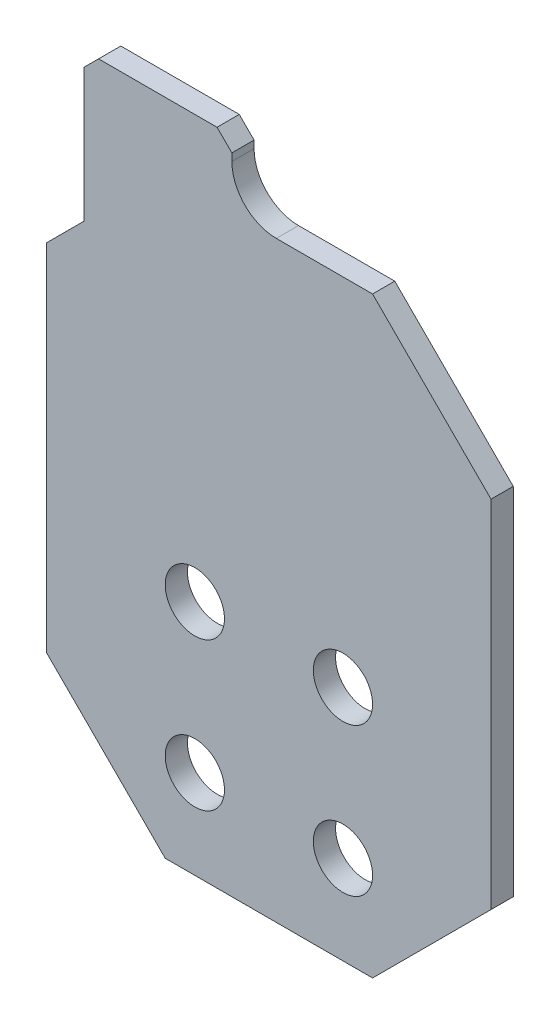
ISO-10303-21;
HEADER;
FILE_DESCRIPTION(('STEP AP214'),'2;1');
FILE_NAME('part.step','',(''),(''),'','','');
FILE_SCHEMA(('AUTOMOTIVE_DESIGN { 1 0 10303 214 1 1 1 1 }'));
ENDSEC;
DATA;
#1=APPLICATION_CONTEXT('core data for automotive mechanical design processes');
#2=APPLICATION_PROTOCOL_DEFINITION('international standard','automotive_design',2000,#1);
#3=PRODUCT_CONTEXT('',#1,'mechanical');
#4=PRODUCT('Part','Part','',(#3));
#5=PRODUCT_RELATED_PRODUCT_CATEGORY('part','',(#4));
#6=PRODUCT_DEFINITION_FORMATION('','',#4);
#7=PRODUCT_DEFINITION_CONTEXT('part definition',#1,'design');
#8=PRODUCT_DEFINITION('design','',#6,#7);
#9=PRODUCT_DEFINITION_SHAPE('','',#8);
#10=(LENGTH_UNIT() NAMED_UNIT(*) SI_UNIT(.MILLI.,.METRE.));
#11=(NAMED_UNIT(*) PLANE_ANGLE_UNIT() SI_UNIT($,.RADIAN.));
#12=(NAMED_UNIT(*) SI_UNIT($,.STERADIAN.) SOLID_ANGLE_UNIT());
#13=UNCERTAINTY_MEASURE_WITH_UNIT(LENGTH_MEASURE(1.E-05),#10,'distance_accuracy_value','');
#14=(GEOMETRIC_REPRESENTATION_CONTEXT(3) GLOBAL_UNCERTAINTY_ASSIGNED_CONTEXT((#13)) GLOBAL_UNIT_ASSIGNED_CONTEXT((#10,
#11,#12)) REPRESENTATION_CONTEXT('',''));
#15=CARTESIAN_POINT('',(0.,0.,0.));
#16=DIRECTION('',(0.,0.,1.));
#17=DIRECTION('',(1.,0.,0.));
#18=AXIS2_PLACEMENT_3D('',#15,#16,#17);
#19=CARTESIAN_POINT('',(0.,0.,1.5));
#20=DIRECTION('',(0.,0.,1.));
#21=DIRECTION('',(1.,0.,0.));
#22=AXIS2_PLACEMENT_3D('',#19,#20,#21);
#23=PLANE('',#22);
#24=DIRECTION('',(-1.,0.,0.));
#25=VECTOR('',#24,1.);
#26=CARTESIAN_POINT('',(0.,0.,1.5));
#27=LINE('',#26,#25);
#28=CARTESIAN_POINT('',(22.,0.,1.5));
#29=VERTEX_POINT('',#28);
#30=CARTESIAN_POINT('',(15.5,0.,1.5));
#31=VERTEX_POINT('',#30);
#32=EDGE_CURVE('E217',#29,#31,#27,.T.);
#33=ORIENTED_EDGE('',*,*,#32,.T.);
#34=CARTESIAN_POINT('',(15.5,3.,1.5));
#35=DIRECTION('',(0.,0.,1.));
#36=DIRECTION('',(1.,0.,0.));
#37=AXIS2_PLACEMENT_3D('',#34,#35,#36);
#38=CIRCLE('',#37,3.);
#39=CARTESIAN_POINT('',(12.5,3.,1.5));
#40=VERTEX_POINT('',#39);
#41=EDGE_CURVE('E40',#31,#40,#38,.F.);
#42=ORIENTED_EDGE('',*,*,#41,.T.);
#43=DIRECTION('',(0.,1.,0.));
#44=VECTOR('',#43,1.);
#45=CARTESIAN_POINT('',(12.5,4.49999999999997,1.5));
#46=LINE('',#45,#44);
#47=CARTESIAN_POINT('',(12.5,3.49999999999997,1.5));
#48=VERTEX_POINT('',#47);
#49=EDGE_CURVE('E269',#40,#48,#46,.T.);
#50=ORIENTED_EDGE('',*,*,#49,.T.);
#51=DIRECTION('',(0.707106781186548,-0.707106781186548,0.));
#52=VECTOR('',#51,1.);
#53=CARTESIAN_POINT('',(7.99999999999998,7.99999999999998,1.5));
#54=LINE('',#53,#52);
#55=CARTESIAN_POINT('',(11.5,4.49999999999997,1.5));
#56=VERTEX_POINT('',#55);
#57=EDGE_CURVE('E196',#48,#56,#54,.F.);
#58=ORIENTED_EDGE('',*,*,#57,.T.);
#59=DIRECTION('',(-1.,0.,0.));
#60=VECTOR('',#59,1.);
#61=CARTESIAN_POINT('',(2.5,4.49999999999997,1.5));
#62=LINE('',#61,#60);
#63=CARTESIAN_POINT('',(3.5,4.49999999999997,1.5));
#64=VERTEX_POINT('',#63);
#65=EDGE_CURVE('E273',#56,#64,#62,.T.);
#66=ORIENTED_EDGE('',*,*,#65,.T.);
#67=DIRECTION('',(0.707106781186548,0.707106781186548,0.));
#68=VECTOR('',#67,1.);
#69=CARTESIAN_POINT('',(-0.499999999999986,0.499999999999986,1.5));
#70=LINE('',#69,#68);
#71=CARTESIAN_POINT('',(2.5,3.49999999999997,1.5));
#72=VERTEX_POINT('',#71);
#73=EDGE_CURVE('E194',#64,#72,#70,.F.);
#74=ORIENTED_EDGE('',*,*,#73,.T.);
#75=DIRECTION('',(0.,-1.,0.));
#76=VECTOR('',#75,1.);
#77=CARTESIAN_POINT('',(2.5,-5.50000000000003,1.5));
#78=LINE('',#77,#76);
#79=CARTESIAN_POINT('',(2.5,-5.50000000000001,1.5));
#80=VERTEX_POINT('',#79);
#81=EDGE_CURVE('E271',#72,#80,#78,.T.);
#82=ORIENTED_EDGE('',*,*,#81,.T.);
#83=DIRECTION('',(0.707106781186549,0.707106781186546,0.));
#84=VECTOR('',#83,1.);
#85=CARTESIAN_POINT('',(4.,-4.00000000000001,1.5));
#86=LINE('',#85,#84);
#87=CARTESIAN_POINT('',(0.,-8.,1.5));
#88=VERTEX_POINT('',#87);
#89=EDGE_CURVE('E150',#80,#88,#86,.F.);
#90=ORIENTED_EDGE('',*,*,#89,.T.);
#91=DIRECTION('',(0.,-1.,0.));
#92=VECTOR('',#91,1.);
#93=CARTESIAN_POINT('',(0.,0.,1.5));
#94=LINE('',#93,#92);
#95=CARTESIAN_POINT('',(0.,-32.,1.5));
#96=VERTEX_POINT('',#95);
#97=EDGE_CURVE('E240',#88,#96,#94,.T.);
#98=ORIENTED_EDGE('',*,*,#97,.T.);
#99=DIRECTION('',(-0.707106781186546,0.707106781186549,0.));
#100=VECTOR('',#99,1.);
#101=CARTESIAN_POINT('',(-16.,-15.9999999999999,1.5));
#102=LINE('',#101,#100);
#103=CARTESIAN_POINT('',(8.,-40.,1.5));
#104=VERTEX_POINT('',#103);
#105=EDGE_CURVE('E181',#96,#104,#102,.F.);
#106=ORIENTED_EDGE('',*,*,#105,.T.);
#107=DIRECTION('',(1.,0.,0.));
#108=VECTOR('',#107,1.);
#109=CARTESIAN_POINT('',(0.,-40.,1.5));
#110=LINE('',#109,#108);
#111=CARTESIAN_POINT('',(21.9999999999999,-40.,1.5));
#112=VERTEX_POINT('',#111);
#113=EDGE_CURVE('E228',#104,#112,#110,.T.);
#114=ORIENTED_EDGE('',*,*,#113,.T.);
#115=DIRECTION('',(-0.707106781186549,-0.707106781186546,0.));
#116=VECTOR('',#115,1.);
#117=CARTESIAN_POINT('',(30.9999999999999,-31.,1.5));
#118=LINE('',#117,#116);
#119=CARTESIAN_POINT('',(30.,-32.,1.5));
#120=VERTEX_POINT('',#119);
#121=EDGE_CURVE('E179',#112,#120,#118,.F.);
#122=ORIENTED_EDGE('',*,*,#121,.T.);
#123=DIRECTION('',(0.,1.,0.));
#124=VECTOR('',#123,1.);
#125=CARTESIAN_POINT('',(30.,0.,1.5));
#126=LINE('',#125,#124);
#127=CARTESIAN_POINT('',(30.,-8.00000000000002,1.5));
#128=VERTEX_POINT('',#127);
#129=EDGE_CURVE('E226',#120,#128,#126,.T.);
#130=ORIENTED_EDGE('',*,*,#129,.T.);
#131=DIRECTION('',(0.707106781186546,-0.707106781186549,0.));
#132=VECTOR('',#131,1.);
#133=CARTESIAN_POINT('',(11.,11.,1.5));
#134=LINE('',#133,#132);
#135=EDGE_CURVE('E177',#128,#29,#134,.F.);
#136=ORIENTED_EDGE('',*,*,#135,.T.);
#137=EDGE_LOOP('',(#33,#42,#50,#58,#66,#74,#82,#90,#98,#106,#114,#122,#130,#136));
#138=FACE_BOUND('',#137,.T.);
#139=CARTESIAN_POINT('',(20.,-24.,1.5));
#140=DIRECTION('',(0.,0.,1.));
#141=DIRECTION('',(1.,0.,0.));
#142=AXIS2_PLACEMENT_3D('',#139,#140,#141);
#143=CIRCLE('',#142,2.);
#144=CARTESIAN_POINT('',(22.,-24.,1.5));
#145=VERTEX_POINT('',#144);
#146=EDGE_CURVE('E256',#145,#145,#143,.T.);
#147=ORIENTED_EDGE('',*,*,#146,.F.);
#148=EDGE_LOOP('',(#147));
#149=FACE_BOUND('',#148,.T.);
#150=CARTESIAN_POINT('',(20.,-34.,1.5));
#151=DIRECTION('',(0.,0.,1.));
#152=DIRECTION('',(1.,0.,0.));
#153=AXIS2_PLACEMENT_3D('',#150,#151,#152);
#154=CIRCLE('',#153,2.00000000000001);
#155=CARTESIAN_POINT('',(22.,-34.,1.5));
#156=VERTEX_POINT('',#155);
#157=EDGE_CURVE('E234',#156,#156,#154,.T.);
#158=ORIENTED_EDGE('',*,*,#157,.F.);
#159=EDGE_LOOP('',(#158));
#160=FACE_BOUND('',#159,.T.);
#161=CARTESIAN_POINT('',(10.,-34.,1.5));
#162=DIRECTION('',(0.,0.,1.));
#163=DIRECTION('',(1.,0.,0.));
#164=AXIS2_PLACEMENT_3D('',#161,#162,#163);
#165=CIRCLE('',#164,2.);
#166=CARTESIAN_POINT('',(12.,-34.,1.5));
#167=VERTEX_POINT('',#166);
#168=EDGE_CURVE('E250',#167,#167,#165,.T.);
#169=ORIENTED_EDGE('',*,*,#168,.F.);
#170=EDGE_LOOP('',(#169));
#171=FACE_BOUND('',#170,.T.);
#172=CARTESIAN_POINT('',(10.,-24.,1.5));
#173=DIRECTION('',(0.,0.,1.));
#174=DIRECTION('',(1.,0.,0.));
#175=AXIS2_PLACEMENT_3D('',#172,#173,#174);
#176=CIRCLE('',#175,2.);
#177=CARTESIAN_POINT('',(12.,-24.,1.5));
#178=VERTEX_POINT('',#177);
#179=EDGE_CURVE('E262',#178,#178,#176,.T.);
#180=ORIENTED_EDGE('',*,*,#179,.F.);
#181=EDGE_LOOP('',(#180));
#182=FACE_BOUND('',#181,.T.);
#183=ADVANCED_FACE('F32',(#138,#149,#160,#171,#182),#23,.T.);
#184=CARTESIAN_POINT('',(0.,0.,0.));
#185=DIRECTION('',(0.,0.,1.));
#186=DIRECTION('',(1.,0.,0.));
#187=AXIS2_PLACEMENT_3D('',#184,#185,#186);
#188=PLANE('',#187);
#189=DIRECTION('',(-1.,0.,0.));
#190=VECTOR('',#189,1.);
#191=CARTESIAN_POINT('',(2.5,4.49999999999997,0.));
#192=LINE('',#191,#190);
#193=CARTESIAN_POINT('',(11.5,4.49999999999997,0.));
#194=VERTEX_POINT('',#193);
#195=CARTESIAN_POINT('',(3.5,4.49999999999997,0.));
#196=VERTEX_POINT('',#195);
#197=EDGE_CURVE('E143',#194,#196,#192,.T.);
#198=ORIENTED_EDGE('',*,*,#197,.F.);
#199=DIRECTION('',(-0.707106781186548,0.707106781186548,0.));
#200=VECTOR('',#199,1.);
#201=CARTESIAN_POINT('',(12.5,3.49999999999997,0.));
#202=LINE('',#201,#200);
#203=CARTESIAN_POINT('',(12.5,3.49999999999997,0.));
#204=VERTEX_POINT('',#203);
#205=EDGE_CURVE('E205',#194,#204,#202,.F.);
#206=ORIENTED_EDGE('',*,*,#205,.T.);
#207=DIRECTION('',(0.,1.,0.));
#208=VECTOR('',#207,1.);
#209=CARTESIAN_POINT('',(12.5,4.49999999999997,0.));
#210=LINE('',#209,#208);
#211=CARTESIAN_POINT('',(12.5,3.,0.));
#212=VERTEX_POINT('',#211);
#213=EDGE_CURVE('E142',#212,#204,#210,.T.);
#214=ORIENTED_EDGE('',*,*,#213,.F.);
#215=CARTESIAN_POINT('',(15.5,3.,0.));
#216=DIRECTION('',(0.,0.,1.));
#217=DIRECTION('',(1.,0.,0.));
#218=AXIS2_PLACEMENT_3D('',#215,#216,#217);
#219=CIRCLE('',#218,3.);
#220=CARTESIAN_POINT('',(15.5,0.,0.));
#221=VERTEX_POINT('',#220);
#222=EDGE_CURVE('E11',#212,#221,#219,.T.);
#223=ORIENTED_EDGE('',*,*,#222,.T.);
#224=DIRECTION('',(-1.,0.,0.));
#225=VECTOR('',#224,1.);
#226=CARTESIAN_POINT('',(0.,0.,0.));
#227=LINE('',#226,#225);
#228=CARTESIAN_POINT('',(22.,0.,0.));
#229=VERTEX_POINT('',#228);
#230=EDGE_CURVE('E220',#229,#221,#227,.T.);
#231=ORIENTED_EDGE('',*,*,#230,.F.);
#232=DIRECTION('',(-0.707106781186546,0.707106781186549,0.));
#233=VECTOR('',#232,1.);
#234=CARTESIAN_POINT('',(22.,0.,0.));
#235=LINE('',#234,#233);
#236=CARTESIAN_POINT('',(30.,-8.00000000000002,0.));
#237=VERTEX_POINT('',#236);
#238=EDGE_CURVE('E159',#229,#237,#235,.F.);
#239=ORIENTED_EDGE('',*,*,#238,.T.);
#240=DIRECTION('',(0.,1.,0.));
#241=VECTOR('',#240,1.);
#242=CARTESIAN_POINT('',(30.,0.,0.));
#243=LINE('',#242,#241);
#244=CARTESIAN_POINT('',(30.,-32.,0.));
#245=VERTEX_POINT('',#244);
#246=EDGE_CURVE('E237',#245,#237,#243,.T.);
#247=ORIENTED_EDGE('',*,*,#246,.F.);
#248=DIRECTION('',(0.707106781186549,0.707106781186546,0.));
#249=VECTOR('',#248,1.);
#250=CARTESIAN_POINT('',(30.,-32.,0.));
#251=LINE('',#250,#249);
#252=CARTESIAN_POINT('',(21.9999999999999,-40.,0.));
#253=VERTEX_POINT('',#252);
#254=EDGE_CURVE('E162',#245,#253,#251,.F.);
#255=ORIENTED_EDGE('',*,*,#254,.T.);
#256=DIRECTION('',(1.,0.,0.));
#257=VECTOR('',#256,1.);
#258=CARTESIAN_POINT('',(0.,-40.,0.));
#259=LINE('',#258,#257);
#260=CARTESIAN_POINT('',(8.,-40.,0.));
#261=VERTEX_POINT('',#260);
#262=EDGE_CURVE('E233',#261,#253,#259,.T.);
#263=ORIENTED_EDGE('',*,*,#262,.F.);
#264=DIRECTION('',(0.707106781186546,-0.707106781186549,0.));
#265=VECTOR('',#264,1.);
#266=CARTESIAN_POINT('',(8.,-40.,0.));
#267=LINE('',#266,#265);
#268=CARTESIAN_POINT('',(0.,-32.,0.));
#269=VERTEX_POINT('',#268);
#270=EDGE_CURVE('E170',#261,#269,#267,.F.);
#271=ORIENTED_EDGE('',*,*,#270,.T.);
#272=DIRECTION('',(0.,-1.,0.));
#273=VECTOR('',#272,1.);
#274=CARTESIAN_POINT('',(0.,0.,0.));
#275=LINE('',#274,#273);
#276=CARTESIAN_POINT('',(0.,-8.,0.));
#277=VERTEX_POINT('',#276);
#278=EDGE_CURVE('E158',#277,#269,#275,.T.);
#279=ORIENTED_EDGE('',*,*,#278,.F.);
#280=DIRECTION('',(-0.707106781186549,-0.707106781186546,0.));
#281=VECTOR('',#280,1.);
#282=CARTESIAN_POINT('',(0.,-8.,0.));
#283=LINE('',#282,#281);
#284=CARTESIAN_POINT('',(2.5,-5.50000000000003,0.));
#285=VERTEX_POINT('',#284);
#286=EDGE_CURVE('E148',#277,#285,#283,.F.);
#287=ORIENTED_EDGE('',*,*,#286,.T.);
#288=DIRECTION('',(0.,-1.,0.));
#289=VECTOR('',#288,1.);
#290=CARTESIAN_POINT('',(2.5,-5.50000000000003,0.));
#291=LINE('',#290,#289);
#292=CARTESIAN_POINT('',(2.5,3.49999999999997,0.));
#293=VERTEX_POINT('',#292);
#294=EDGE_CURVE('E131',#293,#285,#291,.T.);
#295=ORIENTED_EDGE('',*,*,#294,.F.);
#296=DIRECTION('',(-0.707106781186548,-0.707106781186548,0.));
#297=VECTOR('',#296,1.);
#298=CARTESIAN_POINT('',(3.5,4.49999999999997,0.));
#299=LINE('',#298,#297);
#300=EDGE_CURVE('E203',#293,#196,#299,.F.);
#301=ORIENTED_EDGE('',*,*,#300,.T.);
#302=EDGE_LOOP('',(#198,#206,#214,#223,#231,#239,#247,#255,#263,#271,#279,#287,#295,#301));
#303=FACE_BOUND('',#302,.T.);
#304=CARTESIAN_POINT('',(20.,-34.,0.));
#305=DIRECTION('',(0.,0.,1.));
#306=DIRECTION('',(1.,0.,0.));
#307=AXIS2_PLACEMENT_3D('',#304,#305,#306);
#308=CIRCLE('',#307,2.00000000000001);
#309=CARTESIAN_POINT('',(22.,-34.,0.));
#310=VERTEX_POINT('',#309);
#311=EDGE_CURVE('E247',#310,#310,#308,.T.);
#312=ORIENTED_EDGE('',*,*,#311,.T.);
#313=EDGE_LOOP('',(#312));
#314=FACE_BOUND('',#313,.T.);
#315=CARTESIAN_POINT('',(10.,-34.,0.));
#316=DIRECTION('',(0.,0.,1.));
#317=DIRECTION('',(1.,0.,0.));
#318=AXIS2_PLACEMENT_3D('',#315,#316,#317);
#319=CIRCLE('',#318,2.);
#320=CARTESIAN_POINT('',(12.,-34.,0.));
#321=VERTEX_POINT('',#320);
#322=EDGE_CURVE('E253',#321,#321,#319,.T.);
#323=ORIENTED_EDGE('',*,*,#322,.T.);
#324=EDGE_LOOP('',(#323));
#325=FACE_BOUND('',#324,.T.);
#326=CARTESIAN_POINT('',(20.,-24.,0.));
#327=DIRECTION('',(0.,0.,1.));
#328=DIRECTION('',(1.,0.,0.));
#329=AXIS2_PLACEMENT_3D('',#326,#327,#328);
#330=CIRCLE('',#329,2.);
#331=CARTESIAN_POINT('',(22.,-24.,0.));
#332=VERTEX_POINT('',#331);
#333=EDGE_CURVE('E259',#332,#332,#330,.T.);
#334=ORIENTED_EDGE('',*,*,#333,.T.);
#335=EDGE_LOOP('',(#334));
#336=FACE_BOUND('',#335,.T.);
#337=CARTESIAN_POINT('',(10.,-24.,0.));
#338=DIRECTION('',(0.,0.,1.));
#339=DIRECTION('',(1.,0.,0.));
#340=AXIS2_PLACEMENT_3D('',#337,#338,#339);
#341=CIRCLE('',#340,2.);
#342=CARTESIAN_POINT('',(12.,-24.,0.));
#343=VERTEX_POINT('',#342);
#344=EDGE_CURVE('E151',#343,#343,#341,.T.);
#345=ORIENTED_EDGE('',*,*,#344,.T.);
#346=EDGE_LOOP('',(#345));
#347=FACE_BOUND('',#346,.T.);
#348=ADVANCED_FACE('F155',(#303,#314,#325,#336,#347),#188,.F.);
#349=CARTESIAN_POINT('',(0.,0.,1.5));
#350=DIRECTION('',(1.,0.,0.));
#351=DIRECTION('',(0.,1.,0.));
#352=AXIS2_PLACEMENT_3D('',#349,#350,#351);
#353=PLANE('',#352);
#354=ORIENTED_EDGE('',*,*,#278,.T.);
#355=DIRECTION('',(0.,0.,1.));
#356=VECTOR('',#355,1.);
#357=CARTESIAN_POINT('',(0.,-32.,1.5));
#358=LINE('',#357,#356);
#359=EDGE_CURVE('E174',#269,#96,#358,.T.);
#360=ORIENTED_EDGE('',*,*,#359,.T.);
#361=ORIENTED_EDGE('',*,*,#97,.F.);
#362=DIRECTION('',(0.,0.,-1.));
#363=VECTOR('',#362,1.);
#364=CARTESIAN_POINT('',(0.,-8.,1.5));
#365=LINE('',#364,#363);
#366=EDGE_CURVE('E172',#88,#277,#365,.T.);
#367=ORIENTED_EDGE('',*,*,#366,.T.);
#368=EDGE_LOOP('',(#354,#360,#361,#367));
#369=FACE_BOUND('',#368,.T.);
#370=ADVANCED_FACE('F299',(#369),#353,.F.);
#371=CARTESIAN_POINT('',(0.,-40.,1.5));
#372=DIRECTION('',(0.,1.,0.));
#373=DIRECTION('',(-1.,0.,0.));
#374=AXIS2_PLACEMENT_3D('',#371,#372,#373);
#375=PLANE('',#374);
#376=ORIENTED_EDGE('',*,*,#113,.F.);
#377=DIRECTION('',(0.,0.,-1.));
#378=VECTOR('',#377,1.);
#379=CARTESIAN_POINT('',(8.,-40.,1.5));
#380=LINE('',#379,#378);
#381=EDGE_CURVE('E160',#104,#261,#380,.T.);
#382=ORIENTED_EDGE('',*,*,#381,.T.);
#383=ORIENTED_EDGE('',*,*,#262,.T.);
#384=DIRECTION('',(0.,0.,1.));
#385=VECTOR('',#384,1.);
#386=CARTESIAN_POINT('',(22.,-40.,1.5));
#387=LINE('',#386,#385);
#388=EDGE_CURVE('E165',#253,#112,#387,.T.);
#389=ORIENTED_EDGE('',*,*,#388,.T.);
#390=EDGE_LOOP('',(#376,#382,#383,#389));
#391=FACE_BOUND('',#390,.T.);
#392=ADVANCED_FACE('F310',(#391),#375,.F.);
#393=CARTESIAN_POINT('',(30.,0.,1.5));
#394=DIRECTION('',(-1.,0.,0.));
#395=DIRECTION('',(0.,0.,1.));
#396=AXIS2_PLACEMENT_3D('',#393,#394,#395);
#397=PLANE('',#396);
#398=ORIENTED_EDGE('',*,*,#129,.F.);
#399=DIRECTION('',(0.,0.,-1.));
#400=VECTOR('',#399,1.);
#401=CARTESIAN_POINT('',(30.,-32.,1.5));
#402=LINE('',#401,#400);
#403=EDGE_CURVE('E185',#120,#245,#402,.T.);
#404=ORIENTED_EDGE('',*,*,#403,.T.);
#405=ORIENTED_EDGE('',*,*,#246,.T.);
#406=DIRECTION('',(0.,0.,1.));
#407=VECTOR('',#406,1.);
#408=CARTESIAN_POINT('',(30.,-8.00000000000002,1.5));
#409=LINE('',#408,#407);
#410=EDGE_CURVE('E183',#237,#128,#409,.T.);
#411=ORIENTED_EDGE('',*,*,#410,.T.);
#412=EDGE_LOOP('',(#398,#404,#405,#411));
#413=FACE_BOUND('',#412,.T.);
#414=ADVANCED_FACE('F307',(#413),#397,.F.);
#415=CARTESIAN_POINT('',(0.,0.,1.5));
#416=DIRECTION('',(0.,-1.,0.));
#417=DIRECTION('',(1.,0.,0.));
#418=AXIS2_PLACEMENT_3D('',#415,#416,#417);
#419=PLANE('',#418);
#420=ORIENTED_EDGE('',*,*,#230,.T.);
#421=DIRECTION('',(0.,0.,1.));
#422=VECTOR('',#421,1.);
#423=CARTESIAN_POINT('',(15.5,0.,1.5));
#424=LINE('',#423,#422);
#425=EDGE_CURVE('E209',#221,#31,#424,.T.);
#426=ORIENTED_EDGE('',*,*,#425,.T.);
#427=ORIENTED_EDGE('',*,*,#32,.F.);
#428=DIRECTION('',(0.,0.,-1.));
#429=VECTOR('',#428,1.);
#430=CARTESIAN_POINT('',(22.,0.,1.5));
#431=LINE('',#430,#429);
#432=EDGE_CURVE('E188',#29,#229,#431,.T.);
#433=ORIENTED_EDGE('',*,*,#432,.T.);
#434=EDGE_LOOP('',(#420,#426,#427,#433));
#435=FACE_BOUND('',#434,.T.);
#436=ADVANCED_FACE('F216',(#435),#419,.F.);
#437=CARTESIAN_POINT('',(20.,-34.,1.5));
#438=DIRECTION('',(0.,0.,-1.));
#439=DIRECTION('',(-1.,0.,0.));
#440=AXIS2_PLACEMENT_3D('',#437,#438,#439);
#441=CYLINDRICAL_SURFACE('',#440,2.00000000000001);
#442=ORIENTED_EDGE('',*,*,#157,.T.);
#443=EDGE_LOOP('',(#442));
#444=FACE_BOUND('',#443,.T.);
#445=ORIENTED_EDGE('',*,*,#311,.F.);
#446=EDGE_LOOP('',(#445));
#447=FACE_BOUND('',#446,.T.);
#448=ADVANCED_FACE('F302',(#444,#447),#441,.F.);
#449=CARTESIAN_POINT('',(10.,-34.,1.5));
#450=DIRECTION('',(0.,0.,-1.));
#451=DIRECTION('',(-1.,0.,0.));
#452=AXIS2_PLACEMENT_3D('',#449,#450,#451);
#453=CYLINDRICAL_SURFACE('',#452,2.);
#454=ORIENTED_EDGE('',*,*,#168,.T.);
#455=EDGE_LOOP('',(#454));
#456=FACE_BOUND('',#455,.T.);
#457=ORIENTED_EDGE('',*,*,#322,.F.);
#458=EDGE_LOOP('',(#457));
#459=FACE_BOUND('',#458,.T.);
#460=ADVANCED_FACE('F350',(#456,#459),#453,.F.);
#461=CARTESIAN_POINT('',(20.,-24.,1.5));
#462=DIRECTION('',(0.,0.,-1.));
#463=DIRECTION('',(-1.,0.,0.));
#464=AXIS2_PLACEMENT_3D('',#461,#462,#463);
#465=CYLINDRICAL_SURFACE('',#464,2.);
#466=ORIENTED_EDGE('',*,*,#146,.T.);
#467=EDGE_LOOP('',(#466));
#468=FACE_BOUND('',#467,.T.);
#469=ORIENTED_EDGE('',*,*,#333,.F.);
#470=EDGE_LOOP('',(#469));
#471=FACE_BOUND('',#470,.T.);
#472=ADVANCED_FACE('F347',(#468,#471),#465,.F.);
#473=CARTESIAN_POINT('',(10.,-24.,1.5));
#474=DIRECTION('',(0.,0.,-1.));
#475=DIRECTION('',(-1.,0.,0.));
#476=AXIS2_PLACEMENT_3D('',#473,#474,#475);
#477=CYLINDRICAL_SURFACE('',#476,2.);
#478=ORIENTED_EDGE('',*,*,#179,.T.);
#479=EDGE_LOOP('',(#478));
#480=FACE_BOUND('',#479,.T.);
#481=ORIENTED_EDGE('',*,*,#344,.F.);
#482=EDGE_LOOP('',(#481));
#483=FACE_BOUND('',#482,.T.);
#484=ADVANCED_FACE('F322',(#480,#483),#477,.F.);
#485=CARTESIAN_POINT('',(8.,-40.,1.5));
#486=DIRECTION('',(0.707106781186549,0.707106781186546,0.));
#487=DIRECTION('',(0.,0.,-1.));
#488=AXIS2_PLACEMENT_3D('',#485,#486,#487);
#489=PLANE('',#488);
#490=ORIENTED_EDGE('',*,*,#105,.F.);
#491=ORIENTED_EDGE('',*,*,#359,.F.);
#492=ORIENTED_EDGE('',*,*,#270,.F.);
#493=ORIENTED_EDGE('',*,*,#381,.F.);
#494=EDGE_LOOP('',(#490,#491,#492,#493));
#495=FACE_BOUND('',#494,.T.);
#496=ADVANCED_FACE('F318',(#495),#489,.F.);
#497=CARTESIAN_POINT('',(30.,-32.,1.5));
#498=DIRECTION('',(-0.707106781186546,0.707106781186549,0.));
#499=DIRECTION('',(0.,0.,-1.));
#500=AXIS2_PLACEMENT_3D('',#497,#498,#499);
#501=PLANE('',#500);
#502=ORIENTED_EDGE('',*,*,#121,.F.);
#503=ORIENTED_EDGE('',*,*,#388,.F.);
#504=ORIENTED_EDGE('',*,*,#254,.F.);
#505=ORIENTED_EDGE('',*,*,#403,.F.);
#506=EDGE_LOOP('',(#502,#503,#504,#505));
#507=FACE_BOUND('',#506,.T.);
#508=ADVANCED_FACE('F321',(#507),#501,.F.);
#509=CARTESIAN_POINT('',(22.,0.,1.5));
#510=DIRECTION('',(-0.707106781186549,-0.707106781186546,0.));
#511=DIRECTION('',(0.,0.,-1.));
#512=AXIS2_PLACEMENT_3D('',#509,#510,#511);
#513=PLANE('',#512);
#514=ORIENTED_EDGE('',*,*,#135,.F.);
#515=ORIENTED_EDGE('',*,*,#410,.F.);
#516=ORIENTED_EDGE('',*,*,#238,.F.);
#517=ORIENTED_EDGE('',*,*,#432,.F.);
#518=EDGE_LOOP('',(#514,#515,#516,#517));
#519=FACE_BOUND('',#518,.T.);
#520=ADVANCED_FACE('F326',(#519),#513,.F.);
#521=CARTESIAN_POINT('',(0.,-8.,1.5));
#522=DIRECTION('',(0.707106781186546,-0.707106781186549,0.));
#523=DIRECTION('',(0.,0.,-1.));
#524=AXIS2_PLACEMENT_3D('',#521,#522,#523);
#525=PLANE('',#524);
#526=DIRECTION('',(0.,0.,1.));
#527=VECTOR('',#526,1.);
#528=CARTESIAN_POINT('',(2.5,-5.50000000000003,0.));
#529=LINE('',#528,#527);
#530=EDGE_CURVE('E135',#285,#80,#529,.T.);
#531=ORIENTED_EDGE('',*,*,#530,.F.);
#532=ORIENTED_EDGE('',*,*,#286,.F.);
#533=ORIENTED_EDGE('',*,*,#366,.F.);
#534=ORIENTED_EDGE('',*,*,#89,.F.);
#535=EDGE_LOOP('',(#531,#532,#533,#534));
#536=FACE_BOUND('',#535,.T.);
#537=ADVANCED_FACE('F146',(#536),#525,.F.);
#538=CARTESIAN_POINT('',(12.5,4.49999999999997,0.));
#539=DIRECTION('',(1.,0.,0.));
#540=DIRECTION('',(0.,0.,-1.));
#541=AXIS2_PLACEMENT_3D('',#538,#539,#540);
#542=PLANE('',#541);
#543=ORIENTED_EDGE('',*,*,#49,.F.);
#544=DIRECTION('',(0.,0.,1.));
#545=VECTOR('',#544,1.);
#546=CARTESIAN_POINT('',(12.5,3.,0.));
#547=LINE('',#546,#545);
#548=EDGE_CURVE('E53',#40,#212,#547,.F.);
#549=ORIENTED_EDGE('',*,*,#548,.T.);
#550=ORIENTED_EDGE('',*,*,#213,.T.);
#551=DIRECTION('',(0.,0.,1.));
#552=VECTOR('',#551,1.);
#553=CARTESIAN_POINT('',(12.5,3.49999999999997,0.));
#554=LINE('',#553,#552);
#555=EDGE_CURVE('E191',#204,#48,#554,.T.);
#556=ORIENTED_EDGE('',*,*,#555,.T.);
#557=EDGE_LOOP('',(#543,#549,#550,#556));
#558=FACE_BOUND('',#557,.T.);
#559=ADVANCED_FACE('F333',(#558),#542,.T.);
#560=CARTESIAN_POINT('',(2.5,4.49999999999997,0.));
#561=DIRECTION('',(0.,1.,0.));
#562=DIRECTION('',(0.,0.,1.));
#563=AXIS2_PLACEMENT_3D('',#560,#561,#562);
#564=PLANE('',#563);
#565=ORIENTED_EDGE('',*,*,#65,.F.);
#566=DIRECTION('',(0.,0.,-1.));
#567=VECTOR('',#566,1.);
#568=CARTESIAN_POINT('',(11.5,4.49999999999997,0.));
#569=LINE('',#568,#567);
#570=EDGE_CURVE('E201',#56,#194,#569,.T.);
#571=ORIENTED_EDGE('',*,*,#570,.T.);
#572=ORIENTED_EDGE('',*,*,#197,.T.);
#573=DIRECTION('',(0.,0.,1.));
#574=VECTOR('',#573,1.);
#575=CARTESIAN_POINT('',(3.5,4.49999999999997,0.));
#576=LINE('',#575,#574);
#577=EDGE_CURVE('E198',#196,#64,#576,.T.);
#578=ORIENTED_EDGE('',*,*,#577,.T.);
#579=EDGE_LOOP('',(#565,#571,#572,#578));
#580=FACE_BOUND('',#579,.T.);
#581=ADVANCED_FACE('F281',(#580),#564,.T.);
#582=CARTESIAN_POINT('',(2.5,-5.50000000000003,0.));
#583=DIRECTION('',(-1.,0.,0.));
#584=DIRECTION('',(0.,-1.,0.));
#585=AXIS2_PLACEMENT_3D('',#582,#583,#584);
#586=PLANE('',#585);
#587=ORIENTED_EDGE('',*,*,#81,.F.);
#588=DIRECTION('',(0.,0.,-1.));
#589=VECTOR('',#588,1.);
#590=CARTESIAN_POINT('',(2.5,3.49999999999997,0.));
#591=LINE('',#590,#589);
#592=EDGE_CURVE('E138',#72,#293,#591,.T.);
#593=ORIENTED_EDGE('',*,*,#592,.T.);
#594=ORIENTED_EDGE('',*,*,#294,.T.);
#595=ORIENTED_EDGE('',*,*,#530,.T.);
#596=EDGE_LOOP('',(#587,#593,#594,#595));
#597=FACE_BOUND('',#596,.T.);
#598=ADVANCED_FACE('F134',(#597),#586,.T.);
#599=CARTESIAN_POINT('',(12.5,3.49999999999997,0.));
#600=DIRECTION('',(-0.707106781186547,-0.707106781186547,0.));
#601=DIRECTION('',(0.,0.,1.));
#602=AXIS2_PLACEMENT_3D('',#599,#600,#601);
#603=PLANE('',#602);
#604=ORIENTED_EDGE('',*,*,#205,.F.);
#605=ORIENTED_EDGE('',*,*,#570,.F.);
#606=ORIENTED_EDGE('',*,*,#57,.F.);
#607=ORIENTED_EDGE('',*,*,#555,.F.);
#608=EDGE_LOOP('',(#604,#605,#606,#607));
#609=FACE_BOUND('',#608,.T.);
#610=ADVANCED_FACE('F288',(#609),#603,.F.);
#611=CARTESIAN_POINT('',(3.5,4.49999999999997,0.));
#612=DIRECTION('',(0.707106781186547,-0.707106781186547,0.));
#613=DIRECTION('',(0.,0.,1.));
#614=AXIS2_PLACEMENT_3D('',#611,#612,#613);
#615=PLANE('',#614);
#616=ORIENTED_EDGE('',*,*,#300,.F.);
#617=ORIENTED_EDGE('',*,*,#592,.F.);
#618=ORIENTED_EDGE('',*,*,#73,.F.);
#619=ORIENTED_EDGE('',*,*,#577,.F.);
#620=EDGE_LOOP('',(#616,#617,#618,#619));
#621=FACE_BOUND('',#620,.T.);
#622=ADVANCED_FACE('F285',(#621),#615,.F.);
#623=CARTESIAN_POINT('',(15.5,3.,1.5));
#624=DIRECTION('',(0.,0.,1.));
#625=DIRECTION('',(1.,0.,0.));
#626=AXIS2_PLACEMENT_3D('',#623,#624,#625);
#627=CYLINDRICAL_SURFACE('',#626,3.);
#628=ORIENTED_EDGE('',*,*,#222,.F.);
#629=ORIENTED_EDGE('',*,*,#548,.F.);
#630=ORIENTED_EDGE('',*,*,#41,.F.);
#631=ORIENTED_EDGE('',*,*,#425,.F.);
#632=EDGE_LOOP('',(#628,#629,#630,#631));
#633=FACE_BOUND('',#632,.T.);
#634=ADVANCED_FACE('F34',(#633),#627,.F.);
#635=CLOSED_SHELL('',(#183,#348,#370,#392,#414,#436,#448,#460,#472,#484,#496,#508,#520,#537,
#559,#581,#598,#610,#622,#634));
#636=MANIFOLD_SOLID_BREP('B2',#635);
#637=ADVANCED_BREP_SHAPE_REPRESENTATION('',(#18,#636),#14);
#638=SHAPE_DEFINITION_REPRESENTATION(#9,#637);
ENDSEC;
END-ISO-10303-21;
